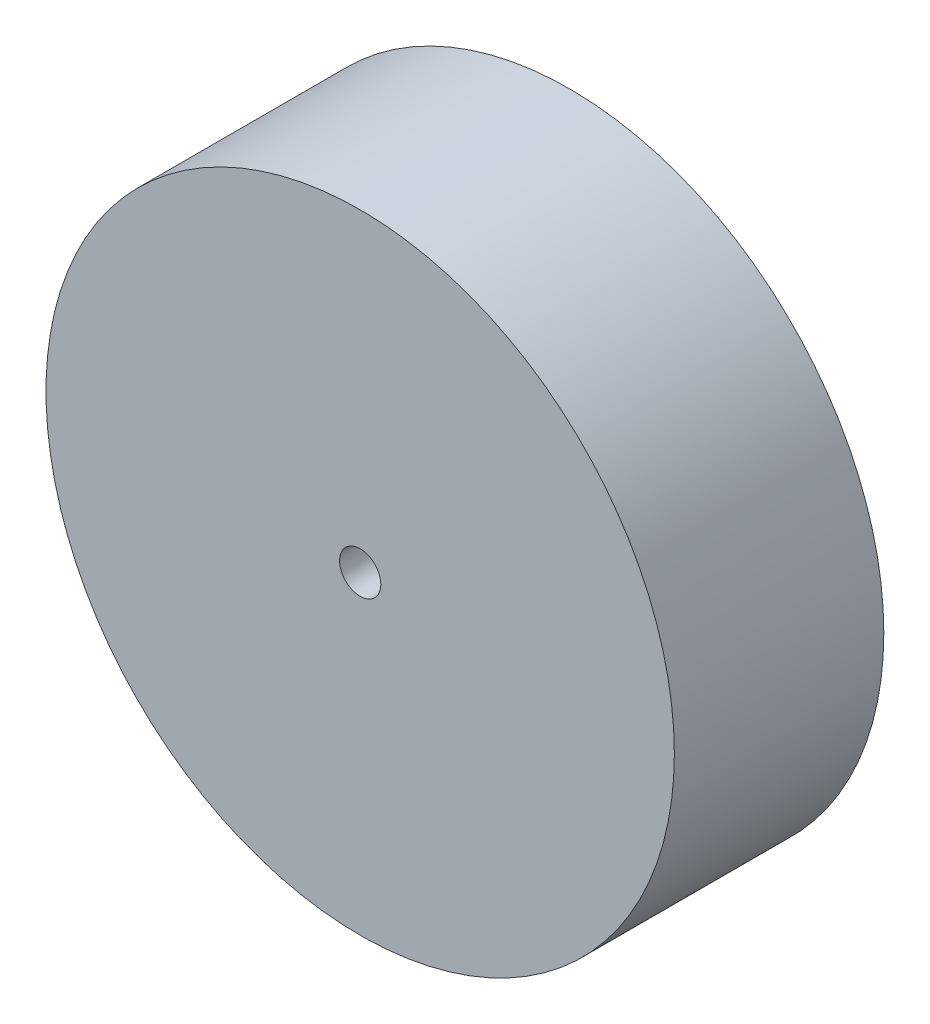
ISO-10303-21;
HEADER;
FILE_DESCRIPTION(('STEP AP214'),'2;1');
FILE_NAME('part.step','',(''),(''),'','','');
FILE_SCHEMA(('AUTOMOTIVE_DESIGN { 1 0 10303 214 1 1 1 1 }'));
ENDSEC;
DATA;
#1=APPLICATION_CONTEXT('core data for automotive mechanical design processes');
#2=APPLICATION_PROTOCOL_DEFINITION('international standard','automotive_design',2000,#1);
#3=PRODUCT_CONTEXT('',#1,'mechanical');
#4=PRODUCT('Part','Part','',(#3));
#5=PRODUCT_RELATED_PRODUCT_CATEGORY('part','',(#4));
#6=PRODUCT_DEFINITION_FORMATION('','',#4);
#7=PRODUCT_DEFINITION_CONTEXT('part definition',#1,'design');
#8=PRODUCT_DEFINITION('design','',#6,#7);
#9=PRODUCT_DEFINITION_SHAPE('','',#8);
#10=(LENGTH_UNIT() NAMED_UNIT(*) SI_UNIT(.MILLI.,.METRE.));
#11=(NAMED_UNIT(*) PLANE_ANGLE_UNIT() SI_UNIT($,.RADIAN.));
#12=(NAMED_UNIT(*) SI_UNIT($,.STERADIAN.) SOLID_ANGLE_UNIT());
#13=UNCERTAINTY_MEASURE_WITH_UNIT(LENGTH_MEASURE(1.E-05),#10,'distance_accuracy_value','');
#14=(GEOMETRIC_REPRESENTATION_CONTEXT(3) GLOBAL_UNCERTAINTY_ASSIGNED_CONTEXT((#13)) GLOBAL_UNIT_ASSIGNED_CONTEXT((#10,
#11,#12)) REPRESENTATION_CONTEXT('',''));
#15=CARTESIAN_POINT('',(0.,0.,0.));
#16=DIRECTION('',(0.,0.,1.));
#17=DIRECTION('',(1.,0.,0.));
#18=AXIS2_PLACEMENT_3D('',#15,#16,#17);
#19=CARTESIAN_POINT('',(0.,0.,25.4));
#20=DIRECTION('',(0.,0.,-1.));
#21=DIRECTION('',(-1.,0.,0.));
#22=AXIS2_PLACEMENT_3D('',#19,#20,#21);
#23=CYLINDRICAL_SURFACE('',#22,38.1);
#24=CARTESIAN_POINT('',(0.,0.,25.4));
#25=DIRECTION('',(0.,0.,1.));
#26=DIRECTION('',(1.,0.,0.));
#27=AXIS2_PLACEMENT_3D('',#24,#25,#26);
#28=CIRCLE('',#27,38.1);
#29=CARTESIAN_POINT('',(38.1,0.,25.4));
#30=VERTEX_POINT('',#29);
#31=EDGE_CURVE('E10',#30,#30,#28,.T.);
#32=ORIENTED_EDGE('',*,*,#31,.F.);
#33=EDGE_LOOP('',(#32));
#34=FACE_BOUND('',#33,.T.);
#35=CARTESIAN_POINT('',(0.,0.,0.));
#36=DIRECTION('',(0.,0.,1.));
#37=DIRECTION('',(1.,0.,0.));
#38=AXIS2_PLACEMENT_3D('',#35,#36,#37);
#39=CIRCLE('',#38,38.1);
#40=CARTESIAN_POINT('',(38.1,0.,0.));
#41=VERTEX_POINT('',#40);
#42=EDGE_CURVE('E31',#41,#41,#39,.T.);
#43=ORIENTED_EDGE('',*,*,#42,.T.);
#44=EDGE_LOOP('',(#43));
#45=FACE_BOUND('',#44,.T.);
#46=ADVANCED_FACE('F28',(#34,#45),#23,.T.);
#47=CARTESIAN_POINT('',(0.,0.,25.4));
#48=DIRECTION('',(0.,0.,1.));
#49=DIRECTION('',(1.,0.,0.));
#50=AXIS2_PLACEMENT_3D('',#47,#48,#49);
#51=PLANE('',#50);
#52=CARTESIAN_POINT('',(0.,0.,25.4));
#53=DIRECTION('',(0.,0.,1.));
#54=DIRECTION('',(1.,0.,0.));
#55=AXIS2_PLACEMENT_3D('',#52,#53,#54);
#56=CIRCLE('',#55,2.5);
#57=CARTESIAN_POINT('',(2.5,0.,25.4));
#58=VERTEX_POINT('',#57);
#59=EDGE_CURVE('E40',#58,#58,#56,.T.);
#60=ORIENTED_EDGE('',*,*,#59,.F.);
#61=EDGE_LOOP('',(#60));
#62=FACE_BOUND('',#61,.T.);
#63=ORIENTED_EDGE('',*,*,#31,.T.);
#64=EDGE_LOOP('',(#63));
#65=FACE_BOUND('',#64,.T.);
#66=ADVANCED_FACE('F55',(#62,#65),#51,.T.);
#67=CARTESIAN_POINT('',(0.,0.,0.));
#68=DIRECTION('',(0.,0.,1.));
#69=DIRECTION('',(1.,0.,0.));
#70=AXIS2_PLACEMENT_3D('',#67,#68,#69);
#71=PLANE('',#70);
#72=ORIENTED_EDGE('',*,*,#42,.F.);
#73=EDGE_LOOP('',(#72));
#74=FACE_BOUND('',#73,.T.);
#75=ADVANCED_FACE('F51',(#74),#71,.F.);
#76=CARTESIAN_POINT('',(0.,0.,10.4));
#77=DIRECTION('',(0.,0.,1.));
#78=DIRECTION('',(1.,0.,0.));
#79=AXIS2_PLACEMENT_3D('',#76,#77,#78);
#80=CYLINDRICAL_SURFACE('',#79,2.5);
#81=CARTESIAN_POINT('',(0.,0.,10.4));
#82=DIRECTION('',(0.,0.,1.));
#83=DIRECTION('',(1.,0.,0.));
#84=AXIS2_PLACEMENT_3D('',#81,#82,#83);
#85=CIRCLE('',#84,2.5);
#86=CARTESIAN_POINT('',(2.5,0.,10.4));
#87=VERTEX_POINT('',#86);
#88=EDGE_CURVE('E38',#87,#87,#85,.T.);
#89=ORIENTED_EDGE('',*,*,#88,.F.);
#90=EDGE_LOOP('',(#89));
#91=FACE_BOUND('',#90,.T.);
#92=ORIENTED_EDGE('',*,*,#59,.T.);
#93=EDGE_LOOP('',(#92));
#94=FACE_BOUND('',#93,.T.);
#95=ADVANCED_FACE('F48',(#91,#94),#80,.F.);
#96=CARTESIAN_POINT('',(0.,0.,10.4));
#97=DIRECTION('',(0.,0.,1.));
#98=DIRECTION('',(1.,0.,0.));
#99=AXIS2_PLACEMENT_3D('',#96,#97,#98);
#100=PLANE('',#99);
#101=ORIENTED_EDGE('',*,*,#88,.T.);
#102=EDGE_LOOP('',(#101));
#103=FACE_BOUND('',#102,.T.);
#104=ADVANCED_FACE('F46',(#103),#100,.T.);
#105=CLOSED_SHELL('',(#46,#66,#75,#95,#104));
#106=MANIFOLD_SOLID_BREP('B2',#105);
#107=ADVANCED_BREP_SHAPE_REPRESENTATION('',(#18,#106),#14);
#108=SHAPE_DEFINITION_REPRESENTATION(#9,#107);
ENDSEC;
END-ISO-10303-21;
